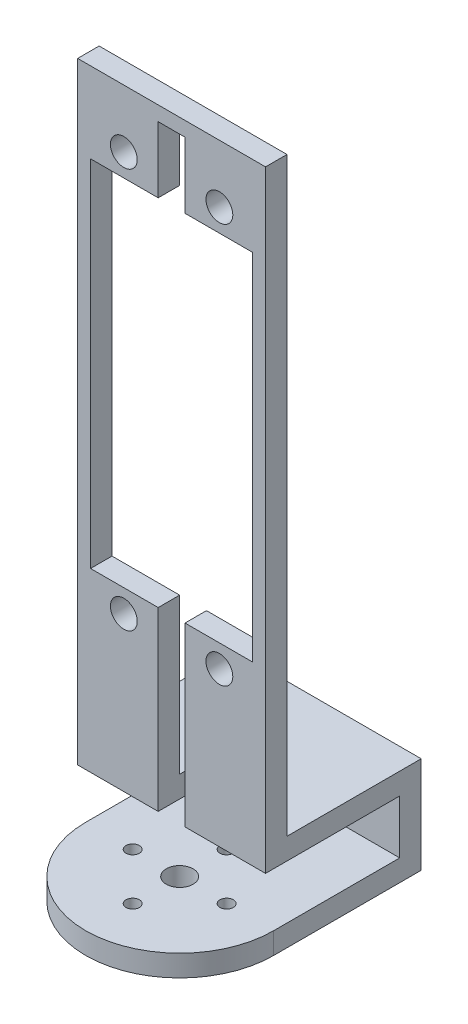
ISO-10303-21;
HEADER;
FILE_DESCRIPTION(('STEP AP214'),'2;1');
FILE_NAME('part.step','',(''),(''),'','','');
FILE_SCHEMA(('AUTOMOTIVE_DESIGN { 1 0 10303 214 1 1 1 1 }'));
ENDSEC;
DATA;
#1=APPLICATION_CONTEXT('core data for automotive mechanical design processes');
#2=APPLICATION_PROTOCOL_DEFINITION('international standard','automotive_design',2000,#1);
#3=PRODUCT_CONTEXT('',#1,'mechanical');
#4=PRODUCT('Part','Part','',(#3));
#5=PRODUCT_RELATED_PRODUCT_CATEGORY('part','',(#4));
#6=PRODUCT_DEFINITION_FORMATION('','',#4);
#7=PRODUCT_DEFINITION_CONTEXT('part definition',#1,'design');
#8=PRODUCT_DEFINITION('design','',#6,#7);
#9=PRODUCT_DEFINITION_SHAPE('','',#8);
#10=(LENGTH_UNIT() NAMED_UNIT(*) SI_UNIT(.MILLI.,.METRE.));
#11=(NAMED_UNIT(*) PLANE_ANGLE_UNIT() SI_UNIT($,.RADIAN.));
#12=(NAMED_UNIT(*) SI_UNIT($,.STERADIAN.) SOLID_ANGLE_UNIT());
#13=UNCERTAINTY_MEASURE_WITH_UNIT(LENGTH_MEASURE(1.E-05),#10,'distance_accuracy_value','');
#14=(GEOMETRIC_REPRESENTATION_CONTEXT(3) GLOBAL_UNCERTAINTY_ASSIGNED_CONTEXT((#13)) GLOBAL_UNIT_ASSIGNED_CONTEXT((#10,
#11,#12)) REPRESENTATION_CONTEXT('',''));
#15=CARTESIAN_POINT('',(0.,0.,0.));
#16=DIRECTION('',(0.,0.,1.));
#17=DIRECTION('',(1.,0.,0.));
#18=AXIS2_PLACEMENT_3D('',#15,#16,#17);
#19=CARTESIAN_POINT('',(0.,4.,0.));
#20=DIRECTION('',(0.,-1.,0.));
#21=DIRECTION('',(0.,0.,-1.));
#22=AXIS2_PLACEMENT_3D('',#19,#20,#21);
#23=CYLINDRICAL_SURFACE('',#22,17.5);
#24=CARTESIAN_POINT('',(0.,0.,0.));
#25=DIRECTION('',(0.,1.,0.));
#26=DIRECTION('',(0.,0.,1.));
#27=AXIS2_PLACEMENT_3D('',#24,#25,#26);
#28=CIRCLE('',#27,17.5);
#29=CARTESIAN_POINT('',(-17.5,0.,0.));
#30=VERTEX_POINT('',#29);
#31=CARTESIAN_POINT('',(17.5,0.,0.));
#32=VERTEX_POINT('',#31);
#33=EDGE_CURVE('E335',#30,#32,#28,.T.);
#34=ORIENTED_EDGE('',*,*,#33,.T.);
#35=DIRECTION('',(0.,-1.,0.));
#36=VECTOR('',#35,1.);
#37=CARTESIAN_POINT('',(17.5,4.,0.));
#38=LINE('',#37,#36);
#39=CARTESIAN_POINT('',(17.5,4.,0.));
#40=VERTEX_POINT('',#39);
#41=EDGE_CURVE('E311',#40,#32,#38,.T.);
#42=ORIENTED_EDGE('',*,*,#41,.F.);
#43=CARTESIAN_POINT('',(0.,4.,0.));
#44=DIRECTION('',(0.,1.,0.));
#45=DIRECTION('',(0.,0.,1.));
#46=AXIS2_PLACEMENT_3D('',#43,#44,#45);
#47=CIRCLE('',#46,17.5);
#48=CARTESIAN_POINT('',(-17.5,4.,0.));
#49=VERTEX_POINT('',#48);
#50=EDGE_CURVE('E329',#49,#40,#47,.T.);
#51=ORIENTED_EDGE('',*,*,#50,.F.);
#52=DIRECTION('',(0.,-1.,0.));
#53=VECTOR('',#52,1.);
#54=CARTESIAN_POINT('',(-17.5,4.,0.));
#55=LINE('',#54,#53);
#56=EDGE_CURVE('E344',#49,#30,#55,.T.);
#57=ORIENTED_EDGE('',*,*,#56,.T.);
#58=EDGE_LOOP('',(#34,#42,#51,#57));
#59=FACE_BOUND('',#58,.T.);
#60=ADVANCED_FACE('F36',(#59),#23,.T.);
#61=CARTESIAN_POINT('',(17.5,4.,-27.5));
#62=DIRECTION('',(-1.,0.,0.));
#63=DIRECTION('',(0.,0.,1.));
#64=AXIS2_PLACEMENT_3D('',#61,#62,#63);
#65=PLANE('',#64);
#66=DIRECTION('',(0.,0.,-1.));
#67=VECTOR('',#66,1.);
#68=CARTESIAN_POINT('',(17.5,0.,-27.5));
#69=LINE('',#68,#67);
#70=CARTESIAN_POINT('',(17.5,0.,-27.5));
#71=VERTEX_POINT('',#70);
#72=EDGE_CURVE('E337',#32,#71,#69,.T.);
#73=ORIENTED_EDGE('',*,*,#72,.T.);
#74=DIRECTION('',(0.,-1.,0.));
#75=VECTOR('',#74,1.);
#76=CARTESIAN_POINT('',(17.5,4.,-27.5));
#77=LINE('',#76,#75);
#78=CARTESIAN_POINT('',(17.5,18.,-27.5));
#79=VERTEX_POINT('',#78);
#80=EDGE_CURVE('E315',#79,#71,#77,.T.);
#81=ORIENTED_EDGE('',*,*,#80,.F.);
#82=DIRECTION('',(0.,0.,-1.));
#83=VECTOR('',#82,1.);
#84=CARTESIAN_POINT('',(17.5,18.,-27.5));
#85=LINE('',#84,#83);
#86=CARTESIAN_POINT('',(17.5,18.,-2.5));
#87=VERTEX_POINT('',#86);
#88=EDGE_CURVE('E397',#87,#79,#85,.T.);
#89=ORIENTED_EDGE('',*,*,#88,.F.);
#90=DIRECTION('',(0.,-1.,0.));
#91=VECTOR('',#90,1.);
#92=CARTESIAN_POINT('',(17.5,18.,-2.5));
#93=LINE('',#92,#91);
#94=CARTESIAN_POINT('',(17.5,128.,-2.5));
#95=VERTEX_POINT('',#94);
#96=EDGE_CURVE('E400',#95,#87,#93,.T.);
#97=ORIENTED_EDGE('',*,*,#96,.F.);
#98=DIRECTION('',(0.,0.,-1.));
#99=VECTOR('',#98,1.);
#100=CARTESIAN_POINT('',(17.5,128.,-2.5));
#101=LINE('',#100,#99);
#102=CARTESIAN_POINT('',(17.5,128.,1.5));
#103=VERTEX_POINT('',#102);
#104=EDGE_CURVE('E404',#103,#95,#101,.T.);
#105=ORIENTED_EDGE('',*,*,#104,.F.);
#106=DIRECTION('',(0.,1.,0.));
#107=VECTOR('',#106,1.);
#108=CARTESIAN_POINT('',(17.5,128.,1.5));
#109=LINE('',#108,#107);
#110=CARTESIAN_POINT('',(17.5,14.,1.5));
#111=VERTEX_POINT('',#110);
#112=EDGE_CURVE('E289',#111,#103,#109,.T.);
#113=ORIENTED_EDGE('',*,*,#112,.F.);
#114=DIRECTION('',(0.,0.,1.));
#115=VECTOR('',#114,1.);
#116=CARTESIAN_POINT('',(17.5,14.,1.5));
#117=LINE('',#116,#115);
#118=CARTESIAN_POINT('',(17.5,14.,-23.5));
#119=VERTEX_POINT('',#118);
#120=EDGE_CURVE('E292',#119,#111,#117,.T.);
#121=ORIENTED_EDGE('',*,*,#120,.F.);
#122=DIRECTION('',(0.,-1.,0.));
#123=VECTOR('',#122,1.);
#124=CARTESIAN_POINT('',(17.5,14.,-23.5));
#125=LINE('',#124,#123);
#126=CARTESIAN_POINT('',(17.5,4.,-23.5));
#127=VERTEX_POINT('',#126);
#128=EDGE_CURVE('E306',#119,#127,#125,.T.);
#129=ORIENTED_EDGE('',*,*,#128,.T.);
#130=DIRECTION('',(0.,0.,-1.));
#131=VECTOR('',#130,1.);
#132=CARTESIAN_POINT('',(17.5,4.,-27.5));
#133=LINE('',#132,#131);
#134=EDGE_CURVE('E325',#40,#127,#133,.T.);
#135=ORIENTED_EDGE('',*,*,#134,.F.);
#136=ORIENTED_EDGE('',*,*,#41,.T.);
#137=EDGE_LOOP('',(#73,#81,#89,#97,#105,#113,#121,#129,#135,#136));
#138=FACE_BOUND('',#137,.T.);
#139=ADVANCED_FACE('F440',(#138),#65,.F.);
#140=CARTESIAN_POINT('',(-17.5,4.,-27.5));
#141=DIRECTION('',(0.,0.,1.));
#142=DIRECTION('',(1.,0.,0.));
#143=AXIS2_PLACEMENT_3D('',#140,#141,#142);
#144=PLANE('',#143);
#145=DIRECTION('',(-1.,0.,0.));
#146=VECTOR('',#145,1.);
#147=CARTESIAN_POINT('',(-17.5,0.,-27.5));
#148=LINE('',#147,#146);
#149=CARTESIAN_POINT('',(-17.5,0.,-27.5));
#150=VERTEX_POINT('',#149);
#151=EDGE_CURVE('E340',#71,#150,#148,.T.);
#152=ORIENTED_EDGE('',*,*,#151,.T.);
#153=DIRECTION('',(0.,-1.,0.));
#154=VECTOR('',#153,1.);
#155=CARTESIAN_POINT('',(-17.5,4.,-27.5));
#156=LINE('',#155,#154);
#157=CARTESIAN_POINT('',(-17.5,18.,-27.5));
#158=VERTEX_POINT('',#157);
#159=EDGE_CURVE('E321',#158,#150,#156,.T.);
#160=ORIENTED_EDGE('',*,*,#159,.F.);
#161=DIRECTION('',(-1.,0.,0.));
#162=VECTOR('',#161,1.);
#163=CARTESIAN_POINT('',(17.5,18.,-27.5));
#164=LINE('',#163,#162);
#165=EDGE_CURVE('E377',#79,#158,#164,.T.);
#166=ORIENTED_EDGE('',*,*,#165,.F.);
#167=ORIENTED_EDGE('',*,*,#80,.T.);
#168=EDGE_LOOP('',(#152,#160,#166,#167));
#169=FACE_BOUND('',#168,.T.);
#170=ADVANCED_FACE('F444',(#169),#144,.F.);
#171=CARTESIAN_POINT('',(-17.5,4.,0.));
#172=DIRECTION('',(1.,0.,0.));
#173=DIRECTION('',(0.,0.,-1.));
#174=AXIS2_PLACEMENT_3D('',#171,#172,#173);
#175=PLANE('',#174);
#176=DIRECTION('',(0.,0.,1.));
#177=VECTOR('',#176,1.);
#178=CARTESIAN_POINT('',(-17.5,0.,0.));
#179=LINE('',#178,#177);
#180=EDGE_CURVE('E342',#150,#30,#179,.T.);
#181=ORIENTED_EDGE('',*,*,#180,.T.);
#182=ORIENTED_EDGE('',*,*,#56,.F.);
#183=DIRECTION('',(0.,0.,1.));
#184=VECTOR('',#183,1.);
#185=CARTESIAN_POINT('',(-17.5,4.,0.));
#186=LINE('',#185,#184);
#187=CARTESIAN_POINT('',(-17.5,4.,-23.5));
#188=VERTEX_POINT('',#187);
#189=EDGE_CURVE('E328',#188,#49,#186,.T.);
#190=ORIENTED_EDGE('',*,*,#189,.F.);
#191=DIRECTION('',(0.,-1.,0.));
#192=VECTOR('',#191,1.);
#193=CARTESIAN_POINT('',(-17.5,14.,-23.5));
#194=LINE('',#193,#192);
#195=CARTESIAN_POINT('',(-17.5,14.,-23.5));
#196=VERTEX_POINT('',#195);
#197=EDGE_CURVE('E338',#196,#188,#194,.T.);
#198=ORIENTED_EDGE('',*,*,#197,.F.);
#199=DIRECTION('',(0.,0.,1.));
#200=VECTOR('',#199,1.);
#201=CARTESIAN_POINT('',(-17.5,14.,1.5));
#202=LINE('',#201,#200);
#203=CARTESIAN_POINT('',(-17.5,14.,1.5));
#204=VERTEX_POINT('',#203);
#205=EDGE_CURVE('E286',#196,#204,#202,.T.);
#206=ORIENTED_EDGE('',*,*,#205,.T.);
#207=DIRECTION('',(0.,1.,0.));
#208=VECTOR('',#207,1.);
#209=CARTESIAN_POINT('',(-17.5,128.,1.5));
#210=LINE('',#209,#208);
#211=CARTESIAN_POINT('',(-17.5,128.,1.5));
#212=VERTEX_POINT('',#211);
#213=EDGE_CURVE('E408',#204,#212,#210,.T.);
#214=ORIENTED_EDGE('',*,*,#213,.T.);
#215=DIRECTION('',(0.,0.,-1.));
#216=VECTOR('',#215,1.);
#217=CARTESIAN_POINT('',(-17.5,128.,-2.5));
#218=LINE('',#217,#216);
#219=CARTESIAN_POINT('',(-17.5,128.,-2.5));
#220=VERTEX_POINT('',#219);
#221=EDGE_CURVE('E411',#212,#220,#218,.T.);
#222=ORIENTED_EDGE('',*,*,#221,.T.);
#223=DIRECTION('',(0.,-1.,0.));
#224=VECTOR('',#223,1.);
#225=CARTESIAN_POINT('',(-17.5,18.,-2.5));
#226=LINE('',#225,#224);
#227=CARTESIAN_POINT('',(-17.5,18.,-2.5));
#228=VERTEX_POINT('',#227);
#229=EDGE_CURVE('E413',#220,#228,#226,.T.);
#230=ORIENTED_EDGE('',*,*,#229,.T.);
#231=DIRECTION('',(0.,0.,-1.));
#232=VECTOR('',#231,1.);
#233=CARTESIAN_POINT('',(-17.5,18.,-27.5));
#234=LINE('',#233,#232);
#235=EDGE_CURVE('E295',#228,#158,#234,.T.);
#236=ORIENTED_EDGE('',*,*,#235,.T.);
#237=ORIENTED_EDGE('',*,*,#159,.T.);
#238=EDGE_LOOP('',(#181,#182,#190,#198,#206,#214,#222,#230,#236,#237));
#239=FACE_BOUND('',#238,.T.);
#240=ADVANCED_FACE('F350',(#239),#175,.F.);
#241=CARTESIAN_POINT('',(0.,4.,0.));
#242=DIRECTION('',(0.,1.,0.));
#243=DIRECTION('',(0.,0.,1.));
#244=AXIS2_PLACEMENT_3D('',#241,#242,#243);
#245=PLANE('',#244);
#246=CARTESIAN_POINT('',(0.,4.,0.));
#247=DIRECTION('',(0.,-1.,0.));
#248=DIRECTION('',(0.,0.,-1.));
#249=AXIS2_PLACEMENT_3D('',#246,#247,#248);
#250=CIRCLE('',#249,2.5);
#251=CARTESIAN_POINT('',(0.,4.,-2.5));
#252=VERTEX_POINT('',#251);
#253=EDGE_CURVE('E562',#252,#252,#250,.T.);
#254=ORIENTED_EDGE('',*,*,#253,.T.);
#255=EDGE_LOOP('',(#254));
#256=FACE_BOUND('',#255,.T.);
#257=CARTESIAN_POINT('',(0.,4.,-8.75));
#258=DIRECTION('',(0.,1.,0.));
#259=DIRECTION('',(0.,0.,1.));
#260=AXIS2_PLACEMENT_3D('',#257,#258,#259);
#261=CIRCLE('',#260,1.25);
#262=CARTESIAN_POINT('',(0.,4.,-7.5));
#263=VERTEX_POINT('',#262);
#264=EDGE_CURVE('E572',#263,#263,#261,.T.);
#265=ORIENTED_EDGE('',*,*,#264,.F.);
#266=EDGE_LOOP('',(#265));
#267=FACE_BOUND('',#266,.T.);
#268=CARTESIAN_POINT('',(0.,4.,8.75));
#269=DIRECTION('',(0.,1.,0.));
#270=DIRECTION('',(0.,0.,1.));
#271=AXIS2_PLACEMENT_3D('',#268,#269,#270);
#272=CIRCLE('',#271,1.25);
#273=CARTESIAN_POINT('',(0.,4.,10.));
#274=VERTEX_POINT('',#273);
#275=EDGE_CURVE('E578',#274,#274,#272,.T.);
#276=ORIENTED_EDGE('',*,*,#275,.F.);
#277=EDGE_LOOP('',(#276));
#278=FACE_BOUND('',#277,.T.);
#279=CARTESIAN_POINT('',(8.75,4.,0.));
#280=DIRECTION('',(0.,1.,0.));
#281=DIRECTION('',(0.,0.,1.));
#282=AXIS2_PLACEMENT_3D('',#279,#280,#281);
#283=CIRCLE('',#282,1.25);
#284=CARTESIAN_POINT('',(8.75,4.,1.24999999999994));
#285=VERTEX_POINT('',#284);
#286=EDGE_CURVE('E584',#285,#285,#283,.T.);
#287=ORIENTED_EDGE('',*,*,#286,.F.);
#288=EDGE_LOOP('',(#287));
#289=FACE_BOUND('',#288,.T.);
#290=CARTESIAN_POINT('',(-8.75,4.,0.));
#291=DIRECTION('',(0.,1.,0.));
#292=DIRECTION('',(0.,0.,1.));
#293=AXIS2_PLACEMENT_3D('',#290,#291,#292);
#294=CIRCLE('',#293,1.24999999999998);
#295=CARTESIAN_POINT('',(-8.75,4.,1.24999999999998));
#296=VERTEX_POINT('',#295);
#297=EDGE_CURVE('E590',#296,#296,#294,.T.);
#298=ORIENTED_EDGE('',*,*,#297,.F.);
#299=EDGE_LOOP('',(#298));
#300=FACE_BOUND('',#299,.T.);
#301=DIRECTION('',(1.,0.,0.));
#302=VECTOR('',#301,1.);
#303=CARTESIAN_POINT('',(-17.5,4.,-23.5));
#304=LINE('',#303,#302);
#305=EDGE_CURVE('E307',#188,#127,#304,.T.);
#306=ORIENTED_EDGE('',*,*,#305,.F.);
#307=ORIENTED_EDGE('',*,*,#189,.T.);
#308=ORIENTED_EDGE('',*,*,#50,.T.);
#309=ORIENTED_EDGE('',*,*,#134,.T.);
#310=EDGE_LOOP('',(#306,#307,#308,#309));
#311=FACE_BOUND('',#310,.T.);
#312=ADVANCED_FACE('F452',(#256,#267,#278,#289,#300,#311),#245,.T.);
#313=CARTESIAN_POINT('',(0.,0.,0.));
#314=DIRECTION('',(0.,1.,0.));
#315=DIRECTION('',(0.,0.,1.));
#316=AXIS2_PLACEMENT_3D('',#313,#314,#315);
#317=PLANE('',#316);
#318=CARTESIAN_POINT('',(0.,0.,0.));
#319=DIRECTION('',(0.,-1.,0.));
#320=DIRECTION('',(0.,0.,-1.));
#321=AXIS2_PLACEMENT_3D('',#318,#319,#320);
#322=CIRCLE('',#321,2.5);
#323=CARTESIAN_POINT('',(0.,0.,-2.5));
#324=VERTEX_POINT('',#323);
#325=EDGE_CURVE('E565',#324,#324,#322,.T.);
#326=ORIENTED_EDGE('',*,*,#325,.F.);
#327=EDGE_LOOP('',(#326));
#328=FACE_BOUND('',#327,.T.);
#329=CARTESIAN_POINT('',(0.,0.,-8.75));
#330=DIRECTION('',(0.,-1.,0.));
#331=DIRECTION('',(0.,0.,-1.));
#332=AXIS2_PLACEMENT_3D('',#329,#330,#331);
#333=CIRCLE('',#332,1.25);
#334=CARTESIAN_POINT('',(0.,0.,-10.));
#335=VERTEX_POINT('',#334);
#336=EDGE_CURVE('E567',#335,#335,#333,.T.);
#337=ORIENTED_EDGE('',*,*,#336,.F.);
#338=EDGE_LOOP('',(#337));
#339=FACE_BOUND('',#338,.T.);
#340=CARTESIAN_POINT('',(0.,0.,8.75));
#341=DIRECTION('',(0.,-1.,0.));
#342=DIRECTION('',(0.,0.,-1.));
#343=AXIS2_PLACEMENT_3D('',#340,#341,#342);
#344=CIRCLE('',#343,1.25);
#345=CARTESIAN_POINT('',(0.,0.,7.5));
#346=VERTEX_POINT('',#345);
#347=EDGE_CURVE('E575',#346,#346,#344,.T.);
#348=ORIENTED_EDGE('',*,*,#347,.F.);
#349=EDGE_LOOP('',(#348));
#350=FACE_BOUND('',#349,.T.);
#351=CARTESIAN_POINT('',(8.75,0.,0.));
#352=DIRECTION('',(0.,-1.,0.));
#353=DIRECTION('',(0.,0.,1.));
#354=AXIS2_PLACEMENT_3D('',#351,#352,#353);
#355=CIRCLE('',#354,1.25);
#356=CARTESIAN_POINT('',(8.75,0.,1.24999999999994));
#357=VERTEX_POINT('',#356);
#358=EDGE_CURVE('E581',#357,#357,#355,.T.);
#359=ORIENTED_EDGE('',*,*,#358,.F.);
#360=EDGE_LOOP('',(#359));
#361=FACE_BOUND('',#360,.T.);
#362=CARTESIAN_POINT('',(-8.75,0.,0.));
#363=DIRECTION('',(0.,-1.,0.));
#364=DIRECTION('',(0.,0.,-1.));
#365=AXIS2_PLACEMENT_3D('',#362,#363,#364);
#366=CIRCLE('',#365,1.24999999999998);
#367=CARTESIAN_POINT('',(-8.75,0.,-1.24999999999998));
#368=VERTEX_POINT('',#367);
#369=EDGE_CURVE('E587',#368,#368,#366,.T.);
#370=ORIENTED_EDGE('',*,*,#369,.F.);
#371=EDGE_LOOP('',(#370));
#372=FACE_BOUND('',#371,.T.);
#373=ORIENTED_EDGE('',*,*,#33,.F.);
#374=ORIENTED_EDGE('',*,*,#180,.F.);
#375=ORIENTED_EDGE('',*,*,#151,.F.);
#376=ORIENTED_EDGE('',*,*,#72,.F.);
#377=EDGE_LOOP('',(#373,#374,#375,#376));
#378=FACE_BOUND('',#377,.T.);
#379=ADVANCED_FACE('F360',(#328,#339,#350,#361,#372,#378),#317,.F.);
#380=CARTESIAN_POINT('',(-17.5,14.,-23.5));
#381=DIRECTION('',(0.,0.,-1.));
#382=DIRECTION('',(-1.,0.,0.));
#383=AXIS2_PLACEMENT_3D('',#380,#381,#382);
#384=PLANE('',#383);
#385=ORIENTED_EDGE('',*,*,#305,.T.);
#386=ORIENTED_EDGE('',*,*,#128,.F.);
#387=DIRECTION('',(1.,0.,0.));
#388=VECTOR('',#387,1.);
#389=CARTESIAN_POINT('',(-17.5,14.,-23.5));
#390=LINE('',#389,#388);
#391=EDGE_CURVE('E303',#196,#119,#390,.T.);
#392=ORIENTED_EDGE('',*,*,#391,.F.);
#393=ORIENTED_EDGE('',*,*,#197,.T.);
#394=EDGE_LOOP('',(#385,#386,#392,#393));
#395=FACE_BOUND('',#394,.T.);
#396=ADVANCED_FACE('F372',(#395),#384,.F.);
#397=CARTESIAN_POINT('',(17.5,14.,1.5));
#398=DIRECTION('',(0.,-1.,0.));
#399=DIRECTION('',(0.,0.,-1.));
#400=AXIS2_PLACEMENT_3D('',#397,#398,#399);
#401=PLANE('',#400);
#402=DIRECTION('',(0.,0.,1.));
#403=VECTOR('',#402,1.);
#404=CARTESIAN_POINT('',(2.5,14.,1.5));
#405=LINE('',#404,#403);
#406=CARTESIAN_POINT('',(2.5,14.,-4.5));
#407=VERTEX_POINT('',#406);
#408=CARTESIAN_POINT('',(2.5,14.,1.5));
#409=VERTEX_POINT('',#408);
#410=EDGE_CURVE('E280',#407,#409,#405,.T.);
#411=ORIENTED_EDGE('',*,*,#410,.F.);
#412=DIRECTION('',(1.,0.,0.));
#413=VECTOR('',#412,1.);
#414=CARTESIAN_POINT('',(17.5,14.,-4.5));
#415=LINE('',#414,#413);
#416=CARTESIAN_POINT('',(-2.5,14.,-4.5));
#417=VERTEX_POINT('',#416);
#418=EDGE_CURVE('E284',#417,#407,#415,.T.);
#419=ORIENTED_EDGE('',*,*,#418,.F.);
#420=DIRECTION('',(0.,0.,-1.));
#421=VECTOR('',#420,1.);
#422=CARTESIAN_POINT('',(-2.5,14.,1.5));
#423=LINE('',#422,#421);
#424=CARTESIAN_POINT('',(-2.5,14.,1.5));
#425=VERTEX_POINT('',#424);
#426=EDGE_CURVE('E274',#425,#417,#423,.T.);
#427=ORIENTED_EDGE('',*,*,#426,.F.);
#428=DIRECTION('',(-1.,0.,0.));
#429=VECTOR('',#428,1.);
#430=CARTESIAN_POINT('',(17.5,14.,1.5));
#431=LINE('',#430,#429);
#432=EDGE_CURVE('E393',#425,#204,#431,.T.);
#433=ORIENTED_EDGE('',*,*,#432,.T.);
#434=ORIENTED_EDGE('',*,*,#205,.F.);
#435=ORIENTED_EDGE('',*,*,#391,.T.);
#436=ORIENTED_EDGE('',*,*,#120,.T.);
#437=EDGE_CURVE('E391',#111,#409,#431,.T.);
#438=ORIENTED_EDGE('',*,*,#437,.T.);
#439=EDGE_LOOP('',(#411,#419,#427,#433,#434,#435,#436,#438));
#440=FACE_BOUND('',#439,.T.);
#441=ADVANCED_FACE('F428',(#440),#401,.T.);
#442=CARTESIAN_POINT('',(17.5,18.,-27.5));
#443=DIRECTION('',(0.,1.,0.));
#444=DIRECTION('',(0.,0.,1.));
#445=AXIS2_PLACEMENT_3D('',#442,#443,#444);
#446=PLANE('',#445);
#447=DIRECTION('',(0.,0.,-1.));
#448=VECTOR('',#447,1.);
#449=CARTESIAN_POINT('',(2.5,18.,-27.5));
#450=LINE('',#449,#448);
#451=CARTESIAN_POINT('',(2.5,18.,-2.5));
#452=VERTEX_POINT('',#451);
#453=CARTESIAN_POINT('',(2.5,18.,-4.5));
#454=VERTEX_POINT('',#453);
#455=EDGE_CURVE('E278',#452,#454,#450,.T.);
#456=ORIENTED_EDGE('',*,*,#455,.F.);
#457=DIRECTION('',(-1.,0.,0.));
#458=VECTOR('',#457,1.);
#459=CARTESIAN_POINT('',(17.5,18.,-2.5));
#460=LINE('',#459,#458);
#461=EDGE_CURVE('E378',#87,#452,#460,.T.);
#462=ORIENTED_EDGE('',*,*,#461,.F.);
#463=ORIENTED_EDGE('',*,*,#88,.T.);
#464=ORIENTED_EDGE('',*,*,#165,.T.);
#465=ORIENTED_EDGE('',*,*,#235,.F.);
#466=CARTESIAN_POINT('',(-2.5,18.,-2.5));
#467=VERTEX_POINT('',#466);
#468=EDGE_CURVE('E383',#467,#228,#460,.T.);
#469=ORIENTED_EDGE('',*,*,#468,.F.);
#470=DIRECTION('',(0.,0.,1.));
#471=VECTOR('',#470,1.);
#472=CARTESIAN_POINT('',(-2.5,18.,-27.5));
#473=LINE('',#472,#471);
#474=CARTESIAN_POINT('',(-2.5,18.,-4.5));
#475=VERTEX_POINT('',#474);
#476=EDGE_CURVE('E272',#475,#467,#473,.T.);
#477=ORIENTED_EDGE('',*,*,#476,.F.);
#478=DIRECTION('',(-1.,0.,0.));
#479=VECTOR('',#478,1.);
#480=CARTESIAN_POINT('',(17.5,18.,-4.5));
#481=LINE('',#480,#479);
#482=EDGE_CURVE('E11',#454,#475,#481,.T.);
#483=ORIENTED_EDGE('',*,*,#482,.F.);
#484=EDGE_LOOP('',(#456,#462,#463,#464,#465,#469,#477,#483));
#485=FACE_BOUND('',#484,.T.);
#486=ADVANCED_FACE('F425',(#485),#446,.T.);
#487=CARTESIAN_POINT('',(17.5,18.,-2.5));
#488=DIRECTION('',(0.,0.,-1.));
#489=DIRECTION('',(-1.,0.,0.));
#490=AXIS2_PLACEMENT_3D('',#487,#488,#489);
#491=PLANE('',#490);
#492=CARTESIAN_POINT('',(8.9,42.7,-2.5));
#493=DIRECTION('',(0.,0.,-1.));
#494=DIRECTION('',(-1.,0.,0.));
#495=AXIS2_PLACEMENT_3D('',#492,#493,#494);
#496=CIRCLE('',#495,2.5);
#497=CARTESIAN_POINT('',(6.4,42.7,-2.5));
#498=VERTEX_POINT('',#497);
#499=EDGE_CURVE('E596',#498,#498,#496,.T.);
#500=ORIENTED_EDGE('',*,*,#499,.F.);
#501=EDGE_LOOP('',(#500));
#502=FACE_BOUND('',#501,.T.);
#503=CARTESIAN_POINT('',(-8.9,42.7,-2.5));
#504=DIRECTION('',(0.,0.,-1.));
#505=DIRECTION('',(-1.,0.,0.));
#506=AXIS2_PLACEMENT_3D('',#503,#504,#505);
#507=CIRCLE('',#506,2.5);
#508=CARTESIAN_POINT('',(-11.4,42.7,-2.5));
#509=VERTEX_POINT('',#508);
#510=EDGE_CURVE('E602',#509,#509,#507,.T.);
#511=ORIENTED_EDGE('',*,*,#510,.F.);
#512=EDGE_LOOP('',(#511));
#513=FACE_BOUND('',#512,.T.);
#514=CARTESIAN_POINT('',(8.9,117.2,-2.5));
#515=DIRECTION('',(0.,0.,-1.));
#516=DIRECTION('',(-1.,0.,0.));
#517=AXIS2_PLACEMENT_3D('',#514,#515,#516);
#518=CIRCLE('',#517,2.5);
#519=CARTESIAN_POINT('',(6.4,117.2,-2.5));
#520=VERTEX_POINT('',#519);
#521=EDGE_CURVE('E608',#520,#520,#518,.T.);
#522=ORIENTED_EDGE('',*,*,#521,.F.);
#523=EDGE_LOOP('',(#522));
#524=FACE_BOUND('',#523,.T.);
#525=CARTESIAN_POINT('',(-8.9,117.2,-2.5));
#526=DIRECTION('',(0.,0.,-1.));
#527=DIRECTION('',(-1.,0.,0.));
#528=AXIS2_PLACEMENT_3D('',#525,#526,#527);
#529=CIRCLE('',#528,2.5);
#530=CARTESIAN_POINT('',(-11.4,117.2,-2.5));
#531=VERTEX_POINT('',#530);
#532=EDGE_CURVE('E614',#531,#531,#529,.T.);
#533=ORIENTED_EDGE('',*,*,#532,.F.);
#534=EDGE_LOOP('',(#533));
#535=FACE_BOUND('',#534,.T.);
#536=DIRECTION('',(0.,-1.,0.));
#537=VECTOR('',#536,1.);
#538=CARTESIAN_POINT('',(2.5,18.,-2.5));
#539=LINE('',#538,#537);
#540=CARTESIAN_POINT('',(2.5,46.9,-2.5));
#541=VERTEX_POINT('',#540);
#542=EDGE_CURVE('E276',#541,#452,#539,.T.);
#543=ORIENTED_EDGE('',*,*,#542,.F.);
#544=DIRECTION('',(-1.,0.,0.));
#545=VECTOR('',#544,1.);
#546=CARTESIAN_POINT('',(17.5,46.9,-2.5));
#547=LINE('',#546,#545);
#548=CARTESIAN_POINT('',(15.1,46.9,-2.5));
#549=VERTEX_POINT('',#548);
#550=EDGE_CURVE('E282',#549,#541,#547,.T.);
#551=ORIENTED_EDGE('',*,*,#550,.F.);
#552=DIRECTION('',(0.,-1.,0.));
#553=VECTOR('',#552,1.);
#554=CARTESIAN_POINT('',(15.1,18.,-2.5));
#555=LINE('',#554,#553);
#556=CARTESIAN_POINT('',(15.1,113.,-2.5));
#557=VERTEX_POINT('',#556);
#558=EDGE_CURVE('E240',#557,#549,#555,.T.);
#559=ORIENTED_EDGE('',*,*,#558,.F.);
#560=DIRECTION('',(1.,0.,0.));
#561=VECTOR('',#560,1.);
#562=CARTESIAN_POINT('',(17.5,113.,-2.5));
#563=LINE('',#562,#561);
#564=CARTESIAN_POINT('',(2.5,113.,-2.5));
#565=VERTEX_POINT('',#564);
#566=EDGE_CURVE('E201',#565,#557,#563,.T.);
#567=ORIENTED_EDGE('',*,*,#566,.F.);
#568=DIRECTION('',(0.,-1.,0.));
#569=VECTOR('',#568,1.);
#570=CARTESIAN_POINT('',(2.5,18.,-2.5));
#571=LINE('',#570,#569);
#572=CARTESIAN_POINT('',(2.5,125.28789597196,-2.5));
#573=VERTEX_POINT('',#572);
#574=EDGE_CURVE('E258',#573,#565,#571,.T.);
#575=ORIENTED_EDGE('',*,*,#574,.F.);
#576=DIRECTION('',(1.,0.,0.));
#577=VECTOR('',#576,1.);
#578=CARTESIAN_POINT('',(17.5,125.28789597196,-2.5));
#579=LINE('',#578,#577);
#580=CARTESIAN_POINT('',(-2.5,125.28789597196,-2.5));
#581=VERTEX_POINT('',#580);
#582=EDGE_CURVE('E260',#581,#573,#579,.T.);
#583=ORIENTED_EDGE('',*,*,#582,.F.);
#584=DIRECTION('',(0.,1.,0.));
#585=VECTOR('',#584,1.);
#586=CARTESIAN_POINT('',(-2.5,18.,-2.5));
#587=LINE('',#586,#585);
#588=CARTESIAN_POINT('',(-2.5,113.,-2.5));
#589=VERTEX_POINT('',#588);
#590=EDGE_CURVE('E262',#589,#581,#587,.T.);
#591=ORIENTED_EDGE('',*,*,#590,.F.);
#592=DIRECTION('',(1.,0.,0.));
#593=VECTOR('',#592,1.);
#594=CARTESIAN_POINT('',(17.5,113.,-2.5));
#595=LINE('',#594,#593);
#596=CARTESIAN_POINT('',(-15.1,113.,-2.5));
#597=VERTEX_POINT('',#596);
#598=EDGE_CURVE('E264',#597,#589,#595,.T.);
#599=ORIENTED_EDGE('',*,*,#598,.F.);
#600=DIRECTION('',(0.,1.,0.));
#601=VECTOR('',#600,1.);
#602=CARTESIAN_POINT('',(-15.1,18.,-2.5));
#603=LINE('',#602,#601);
#604=CARTESIAN_POINT('',(-15.1,46.9,-2.5));
#605=VERTEX_POINT('',#604);
#606=EDGE_CURVE('E266',#605,#597,#603,.T.);
#607=ORIENTED_EDGE('',*,*,#606,.F.);
#608=DIRECTION('',(-1.,0.,0.));
#609=VECTOR('',#608,1.);
#610=CARTESIAN_POINT('',(17.5,46.9,-2.5));
#611=LINE('',#610,#609);
#612=CARTESIAN_POINT('',(-2.5,46.9,-2.5));
#613=VERTEX_POINT('',#612);
#614=EDGE_CURVE('E268',#613,#605,#611,.T.);
#615=ORIENTED_EDGE('',*,*,#614,.F.);
#616=DIRECTION('',(0.,1.,0.));
#617=VECTOR('',#616,1.);
#618=CARTESIAN_POINT('',(-2.5,18.,-2.5));
#619=LINE('',#618,#617);
#620=EDGE_CURVE('E270',#467,#613,#619,.T.);
#621=ORIENTED_EDGE('',*,*,#620,.F.);
#622=ORIENTED_EDGE('',*,*,#468,.T.);
#623=ORIENTED_EDGE('',*,*,#229,.F.);
#624=DIRECTION('',(-1.,0.,0.));
#625=VECTOR('',#624,1.);
#626=CARTESIAN_POINT('',(17.5,128.,-2.5));
#627=LINE('',#626,#625);
#628=EDGE_CURVE('E388',#95,#220,#627,.T.);
#629=ORIENTED_EDGE('',*,*,#628,.F.);
#630=ORIENTED_EDGE('',*,*,#96,.T.);
#631=ORIENTED_EDGE('',*,*,#461,.T.);
#632=EDGE_LOOP('',(#543,#551,#559,#567,#575,#583,#591,#599,#607,#615,#621,#622,#623,#629,#630,#631));
#633=FACE_BOUND('',#632,.T.);
#634=ADVANCED_FACE('F418',(#502,#513,#524,#535,#633),#491,.T.);
#635=CARTESIAN_POINT('',(17.5,128.,-2.5));
#636=DIRECTION('',(0.,1.,0.));
#637=DIRECTION('',(0.,0.,1.));
#638=AXIS2_PLACEMENT_3D('',#635,#636,#637);
#639=PLANE('',#638);
#640=ORIENTED_EDGE('',*,*,#221,.F.);
#641=DIRECTION('',(-1.,0.,0.));
#642=VECTOR('',#641,1.);
#643=CARTESIAN_POINT('',(17.5,128.,1.5));
#644=LINE('',#643,#642);
#645=EDGE_CURVE('E390',#103,#212,#644,.T.);
#646=ORIENTED_EDGE('',*,*,#645,.F.);
#647=ORIENTED_EDGE('',*,*,#104,.T.);
#648=ORIENTED_EDGE('',*,*,#628,.T.);
#649=EDGE_LOOP('',(#640,#646,#647,#648));
#650=FACE_BOUND('',#649,.T.);
#651=ADVANCED_FACE('F434',(#650),#639,.T.);
#652=CARTESIAN_POINT('',(17.5,128.,1.5));
#653=DIRECTION('',(0.,0.,1.));
#654=DIRECTION('',(1.,0.,0.));
#655=AXIS2_PLACEMENT_3D('',#652,#653,#654);
#656=PLANE('',#655);
#657=CARTESIAN_POINT('',(8.9,42.7,1.5));
#658=DIRECTION('',(0.,0.,1.));
#659=DIRECTION('',(1.,0.,0.));
#660=AXIS2_PLACEMENT_3D('',#657,#658,#659);
#661=CIRCLE('',#660,2.5);
#662=CARTESIAN_POINT('',(11.4,42.7,1.5));
#663=VERTEX_POINT('',#662);
#664=EDGE_CURVE('E593',#663,#663,#661,.T.);
#665=ORIENTED_EDGE('',*,*,#664,.F.);
#666=EDGE_LOOP('',(#665));
#667=FACE_BOUND('',#666,.T.);
#668=CARTESIAN_POINT('',(-8.9,42.7,1.5));
#669=DIRECTION('',(0.,0.,1.));
#670=DIRECTION('',(-1.,0.,0.));
#671=AXIS2_PLACEMENT_3D('',#668,#669,#670);
#672=CIRCLE('',#671,2.5);
#673=CARTESIAN_POINT('',(-11.4,42.7,1.5));
#674=VERTEX_POINT('',#673);
#675=EDGE_CURVE('E599',#674,#674,#672,.T.);
#676=ORIENTED_EDGE('',*,*,#675,.F.);
#677=EDGE_LOOP('',(#676));
#678=FACE_BOUND('',#677,.T.);
#679=CARTESIAN_POINT('',(8.9,117.2,1.5));
#680=DIRECTION('',(0.,0.,1.));
#681=DIRECTION('',(-1.,0.,0.));
#682=AXIS2_PLACEMENT_3D('',#679,#680,#681);
#683=CIRCLE('',#682,2.5);
#684=CARTESIAN_POINT('',(6.4,117.2,1.5));
#685=VERTEX_POINT('',#684);
#686=EDGE_CURVE('E605',#685,#685,#683,.T.);
#687=ORIENTED_EDGE('',*,*,#686,.F.);
#688=EDGE_LOOP('',(#687));
#689=FACE_BOUND('',#688,.T.);
#690=CARTESIAN_POINT('',(-8.9,117.2,1.5));
#691=DIRECTION('',(0.,0.,1.));
#692=DIRECTION('',(1.,0.,0.));
#693=AXIS2_PLACEMENT_3D('',#690,#691,#692);
#694=CIRCLE('',#693,2.5);
#695=CARTESIAN_POINT('',(-6.4,117.2,1.5));
#696=VERTEX_POINT('',#695);
#697=EDGE_CURVE('E611',#696,#696,#694,.T.);
#698=ORIENTED_EDGE('',*,*,#697,.F.);
#699=EDGE_LOOP('',(#698));
#700=FACE_BOUND('',#699,.T.);
#701=DIRECTION('',(0.,1.,0.));
#702=VECTOR('',#701,1.);
#703=CARTESIAN_POINT('',(2.5,128.,1.5));
#704=LINE('',#703,#702);
#705=CARTESIAN_POINT('',(2.5,46.9,1.5));
#706=VERTEX_POINT('',#705);
#707=EDGE_CURVE('E43',#409,#706,#704,.T.);
#708=ORIENTED_EDGE('',*,*,#707,.F.);
#709=ORIENTED_EDGE('',*,*,#437,.F.);
#710=ORIENTED_EDGE('',*,*,#112,.T.);
#711=ORIENTED_EDGE('',*,*,#645,.T.);
#712=ORIENTED_EDGE('',*,*,#213,.F.);
#713=ORIENTED_EDGE('',*,*,#432,.F.);
#714=DIRECTION('',(0.,-1.,0.));
#715=VECTOR('',#714,1.);
#716=CARTESIAN_POINT('',(-2.5,10.,1.5));
#717=LINE('',#716,#715);
#718=CARTESIAN_POINT('',(-2.5,46.9,1.5));
#719=VERTEX_POINT('',#718);
#720=EDGE_CURVE('E235',#719,#425,#717,.T.);
#721=ORIENTED_EDGE('',*,*,#720,.F.);
#722=DIRECTION('',(1.,0.,0.));
#723=VECTOR('',#722,1.);
#724=CARTESIAN_POINT('',(-15.1,46.9,1.5));
#725=LINE('',#724,#723);
#726=CARTESIAN_POINT('',(-15.1,46.9,1.5));
#727=VERTEX_POINT('',#726);
#728=EDGE_CURVE('E232',#727,#719,#725,.T.);
#729=ORIENTED_EDGE('',*,*,#728,.F.);
#730=DIRECTION('',(0.,-1.,0.));
#731=VECTOR('',#730,1.);
#732=CARTESIAN_POINT('',(-15.1,113.,1.5));
#733=LINE('',#732,#731);
#734=CARTESIAN_POINT('',(-15.1,113.,1.5));
#735=VERTEX_POINT('',#734);
#736=EDGE_CURVE('E229',#735,#727,#733,.T.);
#737=ORIENTED_EDGE('',*,*,#736,.F.);
#738=DIRECTION('',(-1.,0.,0.));
#739=VECTOR('',#738,1.);
#740=CARTESIAN_POINT('',(-15.1,113.,1.5));
#741=LINE('',#740,#739);
#742=CARTESIAN_POINT('',(-2.5,113.,1.5));
#743=VERTEX_POINT('',#742);
#744=EDGE_CURVE('E226',#743,#735,#741,.T.);
#745=ORIENTED_EDGE('',*,*,#744,.F.);
#746=DIRECTION('',(0.,-1.,0.));
#747=VECTOR('',#746,1.);
#748=CARTESIAN_POINT('',(-2.5,113.,1.5));
#749=LINE('',#748,#747);
#750=CARTESIAN_POINT('',(-2.5,125.28789597196,1.5));
#751=VERTEX_POINT('',#750);
#752=EDGE_CURVE('E223',#751,#743,#749,.T.);
#753=ORIENTED_EDGE('',*,*,#752,.F.);
#754=DIRECTION('',(-1.,0.,0.));
#755=VECTOR('',#754,1.);
#756=CARTESIAN_POINT('',(-2.5,125.28789597196,1.5));
#757=LINE('',#756,#755);
#758=CARTESIAN_POINT('',(2.5,125.28789597196,1.5));
#759=VERTEX_POINT('',#758);
#760=EDGE_CURVE('E217',#759,#751,#757,.T.);
#761=ORIENTED_EDGE('',*,*,#760,.F.);
#762=DIRECTION('',(0.,1.,0.));
#763=VECTOR('',#762,1.);
#764=CARTESIAN_POINT('',(2.5,125.28789597196,1.5));
#765=LINE('',#764,#763);
#766=CARTESIAN_POINT('',(2.5,113.,1.5));
#767=VERTEX_POINT('',#766);
#768=EDGE_CURVE('E215',#767,#759,#765,.T.);
#769=ORIENTED_EDGE('',*,*,#768,.F.);
#770=DIRECTION('',(-1.,0.,0.));
#771=VECTOR('',#770,1.);
#772=CARTESIAN_POINT('',(2.5,113.,1.5));
#773=LINE('',#772,#771);
#774=CARTESIAN_POINT('',(15.1,113.,1.5));
#775=VERTEX_POINT('',#774);
#776=EDGE_CURVE('E198',#775,#767,#773,.T.);
#777=ORIENTED_EDGE('',*,*,#776,.F.);
#778=DIRECTION('',(0.,1.,0.));
#779=VECTOR('',#778,1.);
#780=CARTESIAN_POINT('',(15.1,113.,1.5));
#781=LINE('',#780,#779);
#782=CARTESIAN_POINT('',(15.1,46.9,1.5));
#783=VERTEX_POINT('',#782);
#784=EDGE_CURVE('E207',#783,#775,#781,.T.);
#785=ORIENTED_EDGE('',*,*,#784,.F.);
#786=DIRECTION('',(1.,0.,0.));
#787=VECTOR('',#786,1.);
#788=CARTESIAN_POINT('',(2.5,46.9,1.5));
#789=LINE('',#788,#787);
#790=EDGE_CURVE('E58',#706,#783,#789,.T.);
#791=ORIENTED_EDGE('',*,*,#790,.F.);
#792=EDGE_LOOP('',(#708,#709,#710,#711,#712,#713,#721,#729,#737,#745,#753,#761,#769,#777,#785,#791));
#793=FACE_BOUND('',#792,.T.);
#794=ADVANCED_FACE('F212',(#667,#678,#689,#700,#793),#656,.T.);
#795=CARTESIAN_POINT('',(2.5,46.9,-4.5));
#796=DIRECTION('',(0.,-1.,0.));
#797=DIRECTION('',(0.,0.,-1.));
#798=AXIS2_PLACEMENT_3D('',#795,#796,#797);
#799=PLANE('',#798);
#800=ORIENTED_EDGE('',*,*,#550,.T.);
#801=DIRECTION('',(0.,0.,1.));
#802=VECTOR('',#801,1.);
#803=CARTESIAN_POINT('',(2.5,46.9,-4.5));
#804=LINE('',#803,#802);
#805=EDGE_CURVE('E238',#541,#706,#804,.T.);
#806=ORIENTED_EDGE('',*,*,#805,.T.);
#807=ORIENTED_EDGE('',*,*,#790,.T.);
#808=DIRECTION('',(0.,0.,1.));
#809=VECTOR('',#808,1.);
#810=CARTESIAN_POINT('',(15.1,46.9,-4.5));
#811=LINE('',#810,#809);
#812=EDGE_CURVE('E204',#549,#783,#811,.T.);
#813=ORIENTED_EDGE('',*,*,#812,.F.);
#814=EDGE_LOOP('',(#800,#806,#807,#813));
#815=FACE_BOUND('',#814,.T.);
#816=ADVANCED_FACE('F463',(#815),#799,.F.);
#817=CARTESIAN_POINT('',(2.5,46.9,-4.5));
#818=DIRECTION('',(1.,0.,0.));
#819=DIRECTION('',(0.,0.,-1.));
#820=AXIS2_PLACEMENT_3D('',#817,#818,#819);
#821=PLANE('',#820);
#822=ORIENTED_EDGE('',*,*,#410,.T.);
#823=ORIENTED_EDGE('',*,*,#707,.T.);
#824=ORIENTED_EDGE('',*,*,#805,.F.);
#825=ORIENTED_EDGE('',*,*,#542,.T.);
#826=ORIENTED_EDGE('',*,*,#455,.T.);
#827=DIRECTION('',(0.,1.,0.));
#828=VECTOR('',#827,1.);
#829=CARTESIAN_POINT('',(2.5,46.9,-4.5));
#830=LINE('',#829,#828);
#831=EDGE_CURVE('E255',#407,#454,#830,.T.);
#832=ORIENTED_EDGE('',*,*,#831,.F.);
#833=EDGE_LOOP('',(#822,#823,#824,#825,#826,#832));
#834=FACE_BOUND('',#833,.T.);
#835=ADVANCED_FACE('F477',(#834),#821,.F.);
#836=CARTESIAN_POINT('',(-2.5,10.,-4.5));
#837=DIRECTION('',(-1.,0.,0.));
#838=DIRECTION('',(0.,0.,1.));
#839=AXIS2_PLACEMENT_3D('',#836,#837,#838);
#840=PLANE('',#839);
#841=ORIENTED_EDGE('',*,*,#426,.T.);
#842=DIRECTION('',(0.,-1.,0.));
#843=VECTOR('',#842,1.);
#844=CARTESIAN_POINT('',(-2.5,10.,-4.5));
#845=LINE('',#844,#843);
#846=EDGE_CURVE('E237',#475,#417,#845,.T.);
#847=ORIENTED_EDGE('',*,*,#846,.F.);
#848=ORIENTED_EDGE('',*,*,#476,.T.);
#849=ORIENTED_EDGE('',*,*,#620,.T.);
#850=DIRECTION('',(0.,0.,1.));
#851=VECTOR('',#850,1.);
#852=CARTESIAN_POINT('',(-2.5,46.9,-4.5));
#853=LINE('',#852,#851);
#854=EDGE_CURVE('E241',#613,#719,#853,.T.);
#855=ORIENTED_EDGE('',*,*,#854,.T.);
#856=ORIENTED_EDGE('',*,*,#720,.T.);
#857=EDGE_LOOP('',(#841,#847,#848,#849,#855,#856));
#858=FACE_BOUND('',#857,.T.);
#859=ADVANCED_FACE('F484',(#858),#840,.F.);
#860=CARTESIAN_POINT('',(-15.1,46.9,-4.5));
#861=DIRECTION('',(0.,-1.,0.));
#862=DIRECTION('',(0.,0.,-1.));
#863=AXIS2_PLACEMENT_3D('',#860,#861,#862);
#864=PLANE('',#863);
#865=ORIENTED_EDGE('',*,*,#614,.T.);
#866=DIRECTION('',(0.,0.,1.));
#867=VECTOR('',#866,1.);
#868=CARTESIAN_POINT('',(-15.1,46.9,-4.5));
#869=LINE('',#868,#867);
#870=EDGE_CURVE('E243',#605,#727,#869,.T.);
#871=ORIENTED_EDGE('',*,*,#870,.T.);
#872=ORIENTED_EDGE('',*,*,#728,.T.);
#873=ORIENTED_EDGE('',*,*,#854,.F.);
#874=EDGE_LOOP('',(#865,#871,#872,#873));
#875=FACE_BOUND('',#874,.T.);
#876=ADVANCED_FACE('F511',(#875),#864,.F.);
#877=CARTESIAN_POINT('',(-15.1,113.,-4.5));
#878=DIRECTION('',(-1.,0.,0.));
#879=DIRECTION('',(0.,0.,1.));
#880=AXIS2_PLACEMENT_3D('',#877,#878,#879);
#881=PLANE('',#880);
#882=ORIENTED_EDGE('',*,*,#606,.T.);
#883=DIRECTION('',(0.,0.,1.));
#884=VECTOR('',#883,1.);
#885=CARTESIAN_POINT('',(-15.1,113.,-4.5));
#886=LINE('',#885,#884);
#887=EDGE_CURVE('E245',#597,#735,#886,.T.);
#888=ORIENTED_EDGE('',*,*,#887,.T.);
#889=ORIENTED_EDGE('',*,*,#736,.T.);
#890=ORIENTED_EDGE('',*,*,#870,.F.);
#891=EDGE_LOOP('',(#882,#888,#889,#890));
#892=FACE_BOUND('',#891,.T.);
#893=ADVANCED_FACE('F507',(#892),#881,.F.);
#894=CARTESIAN_POINT('',(-15.1,113.,-4.5));
#895=DIRECTION('',(0.,1.,0.));
#896=DIRECTION('',(0.,0.,1.));
#897=AXIS2_PLACEMENT_3D('',#894,#895,#896);
#898=PLANE('',#897);
#899=ORIENTED_EDGE('',*,*,#598,.T.);
#900=DIRECTION('',(0.,0.,1.));
#901=VECTOR('',#900,1.);
#902=CARTESIAN_POINT('',(-2.5,113.,-4.5));
#903=LINE('',#902,#901);
#904=EDGE_CURVE('E247',#589,#743,#903,.T.);
#905=ORIENTED_EDGE('',*,*,#904,.T.);
#906=ORIENTED_EDGE('',*,*,#744,.T.);
#907=ORIENTED_EDGE('',*,*,#887,.F.);
#908=EDGE_LOOP('',(#899,#905,#906,#907));
#909=FACE_BOUND('',#908,.T.);
#910=ADVANCED_FACE('F503',(#909),#898,.F.);
#911=CARTESIAN_POINT('',(-2.5,113.,-4.5));
#912=DIRECTION('',(-1.,0.,0.));
#913=DIRECTION('',(0.,0.,1.));
#914=AXIS2_PLACEMENT_3D('',#911,#912,#913);
#915=PLANE('',#914);
#916=ORIENTED_EDGE('',*,*,#590,.T.);
#917=DIRECTION('',(0.,0.,1.));
#918=VECTOR('',#917,1.);
#919=CARTESIAN_POINT('',(-2.5,125.28789597196,-4.5));
#920=LINE('',#919,#918);
#921=EDGE_CURVE('E249',#581,#751,#920,.T.);
#922=ORIENTED_EDGE('',*,*,#921,.T.);
#923=ORIENTED_EDGE('',*,*,#752,.T.);
#924=ORIENTED_EDGE('',*,*,#904,.F.);
#925=EDGE_LOOP('',(#916,#922,#923,#924));
#926=FACE_BOUND('',#925,.T.);
#927=ADVANCED_FACE('F499',(#926),#915,.F.);
#928=CARTESIAN_POINT('',(-2.5,125.28789597196,-4.5));
#929=DIRECTION('',(0.,1.,0.));
#930=DIRECTION('',(0.,0.,1.));
#931=AXIS2_PLACEMENT_3D('',#928,#929,#930);
#932=PLANE('',#931);
#933=ORIENTED_EDGE('',*,*,#582,.T.);
#934=DIRECTION('',(0.,0.,1.));
#935=VECTOR('',#934,1.);
#936=CARTESIAN_POINT('',(2.5,125.28789597196,-4.5));
#937=LINE('',#936,#935);
#938=EDGE_CURVE('E251',#573,#759,#937,.T.);
#939=ORIENTED_EDGE('',*,*,#938,.T.);
#940=ORIENTED_EDGE('',*,*,#760,.T.);
#941=ORIENTED_EDGE('',*,*,#921,.F.);
#942=EDGE_LOOP('',(#933,#939,#940,#941));
#943=FACE_BOUND('',#942,.T.);
#944=ADVANCED_FACE('F495',(#943),#932,.F.);
#945=CARTESIAN_POINT('',(2.5,125.28789597196,-4.5));
#946=DIRECTION('',(1.,0.,0.));
#947=DIRECTION('',(0.,1.,0.));
#948=AXIS2_PLACEMENT_3D('',#945,#946,#947);
#949=PLANE('',#948);
#950=ORIENTED_EDGE('',*,*,#574,.T.);
#951=DIRECTION('',(0.,0.,1.));
#952=VECTOR('',#951,1.);
#953=CARTESIAN_POINT('',(2.5,113.,-4.5));
#954=LINE('',#953,#952);
#955=EDGE_CURVE('E203',#565,#767,#954,.T.);
#956=ORIENTED_EDGE('',*,*,#955,.T.);
#957=ORIENTED_EDGE('',*,*,#768,.T.);
#958=ORIENTED_EDGE('',*,*,#938,.F.);
#959=EDGE_LOOP('',(#950,#956,#957,#958));
#960=FACE_BOUND('',#959,.T.);
#961=ADVANCED_FACE('F492',(#960),#949,.F.);
#962=CARTESIAN_POINT('',(2.5,113.,-4.5));
#963=DIRECTION('',(0.,1.,0.));
#964=DIRECTION('',(0.,0.,1.));
#965=AXIS2_PLACEMENT_3D('',#962,#963,#964);
#966=PLANE('',#965);
#967=ORIENTED_EDGE('',*,*,#566,.T.);
#968=DIRECTION('',(0.,0.,1.));
#969=VECTOR('',#968,1.);
#970=CARTESIAN_POINT('',(15.1,113.,-4.5));
#971=LINE('',#970,#969);
#972=EDGE_CURVE('E50',#557,#775,#971,.T.);
#973=ORIENTED_EDGE('',*,*,#972,.T.);
#974=ORIENTED_EDGE('',*,*,#776,.T.);
#975=ORIENTED_EDGE('',*,*,#955,.F.);
#976=EDGE_LOOP('',(#967,#973,#974,#975));
#977=FACE_BOUND('',#976,.T.);
#978=ADVANCED_FACE('F195',(#977),#966,.F.);
#979=CARTESIAN_POINT('',(15.1,113.,-4.5));
#980=DIRECTION('',(1.,0.,0.));
#981=DIRECTION('',(0.,0.,-1.));
#982=AXIS2_PLACEMENT_3D('',#979,#980,#981);
#983=PLANE('',#982);
#984=ORIENTED_EDGE('',*,*,#558,.T.);
#985=ORIENTED_EDGE('',*,*,#812,.T.);
#986=ORIENTED_EDGE('',*,*,#784,.T.);
#987=ORIENTED_EDGE('',*,*,#972,.F.);
#988=EDGE_LOOP('',(#984,#985,#986,#987));
#989=FACE_BOUND('',#988,.T.);
#990=ADVANCED_FACE('F208',(#989),#983,.F.);
#991=CARTESIAN_POINT('',(0.,0.,-4.5));
#992=DIRECTION('',(0.,0.,-1.));
#993=DIRECTION('',(-1.,0.,0.));
#994=AXIS2_PLACEMENT_3D('',#991,#992,#993);
#995=PLANE('',#994);
#996=ORIENTED_EDGE('',*,*,#418,.T.);
#997=ORIENTED_EDGE('',*,*,#831,.T.);
#998=ORIENTED_EDGE('',*,*,#482,.T.);
#999=ORIENTED_EDGE('',*,*,#846,.T.);
#1000=EDGE_LOOP('',(#996,#997,#998,#999));
#1001=FACE_BOUND('',#1000,.T.);
#1002=ADVANCED_FACE('F489',(#1001),#995,.F.);
#1003=CARTESIAN_POINT('',(-8.9,117.2,-4.5));
#1004=DIRECTION('',(0.,0.,1.));
#1005=DIRECTION('',(1.,0.,0.));
#1006=AXIS2_PLACEMENT_3D('',#1003,#1004,#1005);
#1007=CYLINDRICAL_SURFACE('',#1006,2.5);
#1008=ORIENTED_EDGE('',*,*,#532,.T.);
#1009=EDGE_LOOP('',(#1008));
#1010=FACE_BOUND('',#1009,.T.);
#1011=ORIENTED_EDGE('',*,*,#697,.T.);
#1012=EDGE_LOOP('',(#1011));
#1013=FACE_BOUND('',#1012,.T.);
#1014=ADVANCED_FACE('F521',(#1010,#1013),#1007,.F.);
#1015=CARTESIAN_POINT('',(8.9,117.2,-4.5));
#1016=DIRECTION('',(0.,0.,1.));
#1017=DIRECTION('',(1.,0.,0.));
#1018=AXIS2_PLACEMENT_3D('',#1015,#1016,#1017);
#1019=CYLINDRICAL_SURFACE('',#1018,2.5);
#1020=ORIENTED_EDGE('',*,*,#521,.T.);
#1021=EDGE_LOOP('',(#1020));
#1022=FACE_BOUND('',#1021,.T.);
#1023=ORIENTED_EDGE('',*,*,#686,.T.);
#1024=EDGE_LOOP('',(#1023));
#1025=FACE_BOUND('',#1024,.T.);
#1026=ADVANCED_FACE('F525',(#1022,#1025),#1019,.F.);
#1027=CARTESIAN_POINT('',(-8.9,42.7,-4.5));
#1028=DIRECTION('',(0.,0.,1.));
#1029=DIRECTION('',(1.,0.,0.));
#1030=AXIS2_PLACEMENT_3D('',#1027,#1028,#1029);
#1031=CYLINDRICAL_SURFACE('',#1030,2.5);
#1032=ORIENTED_EDGE('',*,*,#510,.T.);
#1033=EDGE_LOOP('',(#1032));
#1034=FACE_BOUND('',#1033,.T.);
#1035=ORIENTED_EDGE('',*,*,#675,.T.);
#1036=EDGE_LOOP('',(#1035));
#1037=FACE_BOUND('',#1036,.T.);
#1038=ADVANCED_FACE('F529',(#1034,#1037),#1031,.F.);
#1039=CARTESIAN_POINT('',(8.9,42.7,-4.5));
#1040=DIRECTION('',(0.,0.,1.));
#1041=DIRECTION('',(1.,0.,0.));
#1042=AXIS2_PLACEMENT_3D('',#1039,#1040,#1041);
#1043=CYLINDRICAL_SURFACE('',#1042,2.5);
#1044=ORIENTED_EDGE('',*,*,#499,.T.);
#1045=EDGE_LOOP('',(#1044));
#1046=FACE_BOUND('',#1045,.T.);
#1047=ORIENTED_EDGE('',*,*,#664,.T.);
#1048=EDGE_LOOP('',(#1047));
#1049=FACE_BOUND('',#1048,.T.);
#1050=ADVANCED_FACE('F533',(#1046,#1049),#1043,.F.);
#1051=CARTESIAN_POINT('',(-8.75,6.,0.));
#1052=DIRECTION('',(0.,-1.,0.));
#1053=DIRECTION('',(0.,0.,-1.));
#1054=AXIS2_PLACEMENT_3D('',#1051,#1052,#1053);
#1055=CYLINDRICAL_SURFACE('',#1054,1.24999999999998);
#1056=ORIENTED_EDGE('',*,*,#297,.T.);
#1057=EDGE_LOOP('',(#1056));
#1058=FACE_BOUND('',#1057,.T.);
#1059=ORIENTED_EDGE('',*,*,#369,.T.);
#1060=EDGE_LOOP('',(#1059));
#1061=FACE_BOUND('',#1060,.T.);
#1062=ADVANCED_FACE('F537',(#1058,#1061),#1055,.F.);
#1063=CARTESIAN_POINT('',(8.75,6.,0.));
#1064=DIRECTION('',(0.,-1.,0.));
#1065=DIRECTION('',(0.,0.,-1.));
#1066=AXIS2_PLACEMENT_3D('',#1063,#1064,#1065);
#1067=CYLINDRICAL_SURFACE('',#1066,1.25);
#1068=ORIENTED_EDGE('',*,*,#286,.T.);
#1069=EDGE_LOOP('',(#1068));
#1070=FACE_BOUND('',#1069,.T.);
#1071=ORIENTED_EDGE('',*,*,#358,.T.);
#1072=EDGE_LOOP('',(#1071));
#1073=FACE_BOUND('',#1072,.T.);
#1074=ADVANCED_FACE('F541',(#1070,#1073),#1067,.F.);
#1075=CARTESIAN_POINT('',(0.,6.,8.75));
#1076=DIRECTION('',(0.,-1.,0.));
#1077=DIRECTION('',(0.,0.,-1.));
#1078=AXIS2_PLACEMENT_3D('',#1075,#1076,#1077);
#1079=CYLINDRICAL_SURFACE('',#1078,1.25);
#1080=ORIENTED_EDGE('',*,*,#275,.T.);
#1081=EDGE_LOOP('',(#1080));
#1082=FACE_BOUND('',#1081,.T.);
#1083=ORIENTED_EDGE('',*,*,#347,.T.);
#1084=EDGE_LOOP('',(#1083));
#1085=FACE_BOUND('',#1084,.T.);
#1086=ADVANCED_FACE('F545',(#1082,#1085),#1079,.F.);
#1087=CARTESIAN_POINT('',(0.,6.,-8.75));
#1088=DIRECTION('',(0.,-1.,0.));
#1089=DIRECTION('',(0.,0.,-1.));
#1090=AXIS2_PLACEMENT_3D('',#1087,#1088,#1089);
#1091=CYLINDRICAL_SURFACE('',#1090,1.25);
#1092=ORIENTED_EDGE('',*,*,#264,.T.);
#1093=EDGE_LOOP('',(#1092));
#1094=FACE_BOUND('',#1093,.T.);
#1095=ORIENTED_EDGE('',*,*,#336,.T.);
#1096=EDGE_LOOP('',(#1095));
#1097=FACE_BOUND('',#1096,.T.);
#1098=ADVANCED_FACE('F549',(#1094,#1097),#1091,.F.);
#1099=CARTESIAN_POINT('',(0.,4.,0.));
#1100=DIRECTION('',(0.,-1.,0.));
#1101=DIRECTION('',(0.,0.,-1.));
#1102=AXIS2_PLACEMENT_3D('',#1099,#1100,#1101);
#1103=CYLINDRICAL_SURFACE('',#1102,2.5);
#1104=ORIENTED_EDGE('',*,*,#253,.F.);
#1105=EDGE_LOOP('',(#1104));
#1106=FACE_BOUND('',#1105,.T.);
#1107=ORIENTED_EDGE('',*,*,#325,.T.);
#1108=EDGE_LOOP('',(#1107));
#1109=FACE_BOUND('',#1108,.T.);
#1110=ADVANCED_FACE('F553',(#1106,#1109),#1103,.F.);
#1111=CLOSED_SHELL('',(#60,#139,#170,#240,#312,#379,#396,#441,#486,#634,#651,#794,#816,#835,
#859,#876,#893,#910,#927,#944,#961,#978,#990,#1002,#1014,#1026,#1038,#1050,#1062,#1074,#1086,
#1098,#1110));
#1112=MANIFOLD_SOLID_BREP('B2',#1111);
#1113=ADVANCED_BREP_SHAPE_REPRESENTATION('',(#18,#1112),#14);
#1114=SHAPE_DEFINITION_REPRESENTATION(#9,#1113);
ENDSEC;
END-ISO-10303-21;
